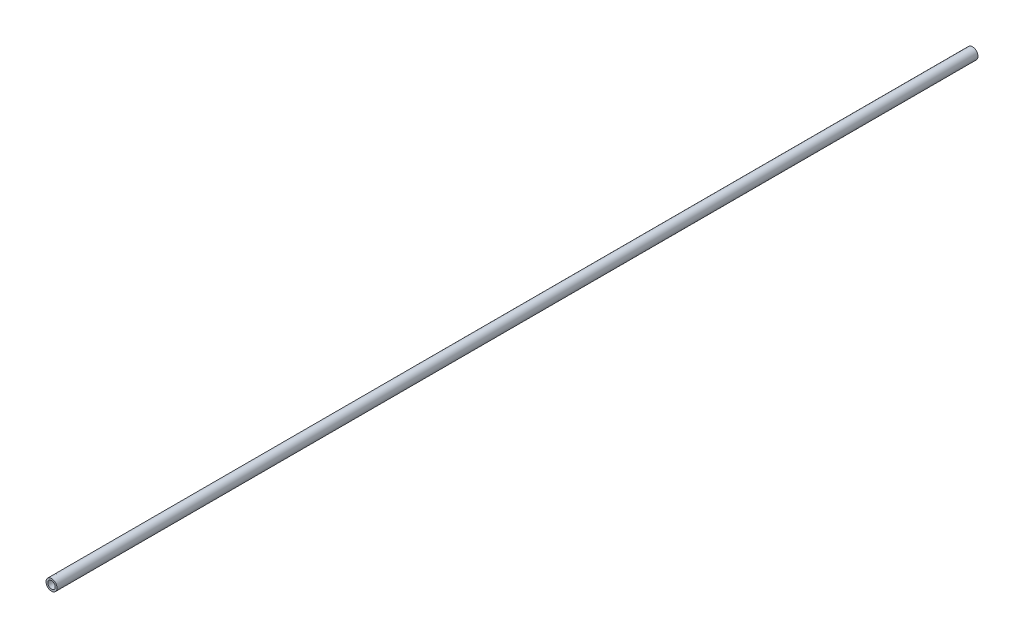
ISO-10303-21;
HEADER;
FILE_DESCRIPTION(('STEP AP214'),'2;1');
FILE_NAME('part.step','',(''),(''),'','','');
FILE_SCHEMA(('AUTOMOTIVE_DESIGN { 1 0 10303 214 1 1 1 1 }'));
ENDSEC;
DATA;
#1=APPLICATION_CONTEXT('core data for automotive mechanical design processes');
#2=APPLICATION_PROTOCOL_DEFINITION('international standard','automotive_design',2000,#1);
#3=PRODUCT_CONTEXT('',#1,'mechanical');
#4=PRODUCT('Part','Part','',(#3));
#5=PRODUCT_RELATED_PRODUCT_CATEGORY('part','',(#4));
#6=PRODUCT_DEFINITION_FORMATION('','',#4);
#7=PRODUCT_DEFINITION_CONTEXT('part definition',#1,'design');
#8=PRODUCT_DEFINITION('design','',#6,#7);
#9=PRODUCT_DEFINITION_SHAPE('','',#8);
#10=(LENGTH_UNIT() NAMED_UNIT(*) SI_UNIT(.MILLI.,.METRE.));
#11=(NAMED_UNIT(*) PLANE_ANGLE_UNIT() SI_UNIT($,.RADIAN.));
#12=(NAMED_UNIT(*) SI_UNIT($,.STERADIAN.) SOLID_ANGLE_UNIT());
#13=UNCERTAINTY_MEASURE_WITH_UNIT(LENGTH_MEASURE(1.E-05),#10,'distance_accuracy_value','');
#14=(GEOMETRIC_REPRESENTATION_CONTEXT(3) GLOBAL_UNCERTAINTY_ASSIGNED_CONTEXT((#13)) GLOBAL_UNIT_ASSIGNED_CONTEXT((#10,
#11,#12)) REPRESENTATION_CONTEXT('',''));
#15=CARTESIAN_POINT('',(0.,0.,0.));
#16=DIRECTION('',(0.,0.,1.));
#17=DIRECTION('',(1.,0.,0.));
#18=AXIS2_PLACEMENT_3D('',#15,#16,#17);
#19=CARTESIAN_POINT('',(0.,0.,250.));
#20=DIRECTION('',(0.,0.,1.));
#21=DIRECTION('',(1.,0.,0.));
#22=AXIS2_PLACEMENT_3D('',#19,#20,#21);
#23=PLANE('',#22);
#24=CARTESIAN_POINT('',(0.,0.,250.));
#25=DIRECTION('',(0.,0.,1.));
#26=DIRECTION('',(1.,0.,0.));
#27=AXIS2_PLACEMENT_3D('',#24,#25,#26);
#28=CIRCLE('',#27,3.);
#29=CARTESIAN_POINT('',(3.,0.,250.));
#30=VERTEX_POINT('',#29);
#31=EDGE_CURVE('E10',#30,#30,#28,.T.);
#32=ORIENTED_EDGE('',*,*,#31,.T.);
#33=EDGE_LOOP('',(#32));
#34=FACE_BOUND('',#33,.T.);
#35=CARTESIAN_POINT('',(0.,0.,250.));
#36=DIRECTION('',(0.,0.,1.));
#37=DIRECTION('',(1.,0.,0.));
#38=AXIS2_PLACEMENT_3D('',#35,#36,#37);
#39=CIRCLE('',#38,2.);
#40=CARTESIAN_POINT('',(2.,0.,250.));
#41=VERTEX_POINT('',#40);
#42=EDGE_CURVE('E50',#41,#41,#39,.T.);
#43=ORIENTED_EDGE('',*,*,#42,.F.);
#44=EDGE_LOOP('',(#43));
#45=FACE_BOUND('',#44,.T.);
#46=ADVANCED_FACE('F37',(#34,#45),#23,.T.);
#47=CARTESIAN_POINT('',(0.,0.,-250.));
#48=DIRECTION('',(0.,0.,1.));
#49=DIRECTION('',(1.,0.,0.));
#50=AXIS2_PLACEMENT_3D('',#47,#48,#49);
#51=PLANE('',#50);
#52=CARTESIAN_POINT('',(0.,0.,-250.));
#53=DIRECTION('',(0.,0.,1.));
#54=DIRECTION('',(1.,0.,0.));
#55=AXIS2_PLACEMENT_3D('',#52,#53,#54);
#56=CIRCLE('',#55,3.);
#57=CARTESIAN_POINT('',(3.,0.,-250.));
#58=VERTEX_POINT('',#57);
#59=EDGE_CURVE('E41',#58,#58,#56,.T.);
#60=ORIENTED_EDGE('',*,*,#59,.F.);
#61=EDGE_LOOP('',(#60));
#62=FACE_BOUND('',#61,.T.);
#63=CARTESIAN_POINT('',(0.,0.,-250.));
#64=DIRECTION('',(0.,0.,1.));
#65=DIRECTION('',(1.,0.,0.));
#66=AXIS2_PLACEMENT_3D('',#63,#64,#65);
#67=CIRCLE('',#66,2.);
#68=CARTESIAN_POINT('',(2.,0.,-250.));
#69=VERTEX_POINT('',#68);
#70=EDGE_CURVE('E52',#69,#69,#67,.T.);
#71=ORIENTED_EDGE('',*,*,#70,.T.);
#72=EDGE_LOOP('',(#71));
#73=FACE_BOUND('',#72,.T.);
#74=ADVANCED_FACE('F64',(#62,#73),#51,.F.);
#75=CARTESIAN_POINT('',(0.,0.,250.));
#76=DIRECTION('',(0.,0.,-1.));
#77=DIRECTION('',(-1.,0.,0.));
#78=AXIS2_PLACEMENT_3D('',#75,#76,#77);
#79=CYLINDRICAL_SURFACE('',#78,3.);
#80=ORIENTED_EDGE('',*,*,#31,.F.);
#81=EDGE_LOOP('',(#80));
#82=FACE_BOUND('',#81,.T.);
#83=ORIENTED_EDGE('',*,*,#59,.T.);
#84=EDGE_LOOP('',(#83));
#85=FACE_BOUND('',#84,.T.);
#86=ADVANCED_FACE('F39',(#82,#85),#79,.T.);
#87=CARTESIAN_POINT('',(0.,0.,250.));
#88=DIRECTION('',(0.,0.,-1.));
#89=DIRECTION('',(-1.,0.,0.));
#90=AXIS2_PLACEMENT_3D('',#87,#88,#89);
#91=CYLINDRICAL_SURFACE('',#90,2.);
#92=ORIENTED_EDGE('',*,*,#42,.T.);
#93=EDGE_LOOP('',(#92));
#94=FACE_BOUND('',#93,.T.);
#95=ORIENTED_EDGE('',*,*,#70,.F.);
#96=EDGE_LOOP('',(#95));
#97=FACE_BOUND('',#96,.T.);
#98=ADVANCED_FACE('F60',(#94,#97),#91,.F.);
#99=CLOSED_SHELL('',(#46,#74,#86,#98));
#100=MANIFOLD_SOLID_BREP('B2',#99);
#101=ADVANCED_BREP_SHAPE_REPRESENTATION('',(#18,#100),#14);
#102=SHAPE_DEFINITION_REPRESENTATION(#9,#101);
ENDSEC;
END-ISO-10303-21;
